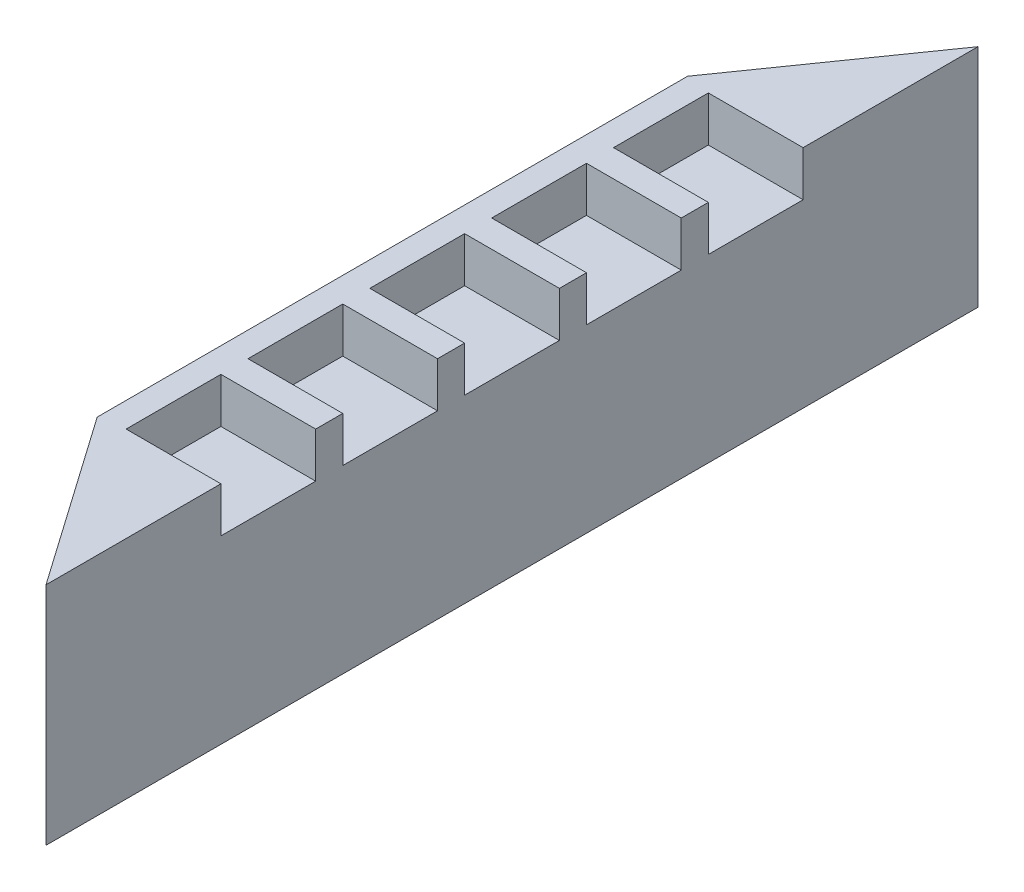
ISO-10303-21;
HEADER;
FILE_DESCRIPTION(('STEP AP214'),'2;1');
FILE_NAME('part.step','',(''),(''),'','','');
FILE_SCHEMA(('AUTOMOTIVE_DESIGN { 1 0 10303 214 1 1 1 1 }'));
ENDSEC;
DATA;
#1=APPLICATION_CONTEXT('core data for automotive mechanical design processes');
#2=APPLICATION_PROTOCOL_DEFINITION('international standard','automotive_design',2000,#1);
#3=PRODUCT_CONTEXT('',#1,'mechanical');
#4=PRODUCT('Part','Part','',(#3));
#5=PRODUCT_RELATED_PRODUCT_CATEGORY('part','',(#4));
#6=PRODUCT_DEFINITION_FORMATION('','',#4);
#7=PRODUCT_DEFINITION_CONTEXT('part definition',#1,'design');
#8=PRODUCT_DEFINITION('design','',#6,#7);
#9=PRODUCT_DEFINITION_SHAPE('','',#8);
#10=(LENGTH_UNIT() NAMED_UNIT(*) SI_UNIT(.MILLI.,.METRE.));
#11=(NAMED_UNIT(*) PLANE_ANGLE_UNIT() SI_UNIT($,.RADIAN.));
#12=(NAMED_UNIT(*) SI_UNIT($,.STERADIAN.) SOLID_ANGLE_UNIT());
#13=UNCERTAINTY_MEASURE_WITH_UNIT(LENGTH_MEASURE(1.E-05),#10,'distance_accuracy_value','');
#14=(GEOMETRIC_REPRESENTATION_CONTEXT(3) GLOBAL_UNCERTAINTY_ASSIGNED_CONTEXT((#13)) GLOBAL_UNIT_ASSIGNED_CONTEXT((#10,
#11,#12)) REPRESENTATION_CONTEXT('',''));
#15=CARTESIAN_POINT('',(0.,0.,0.));
#16=DIRECTION('',(0.,0.,1.));
#17=DIRECTION('',(1.,0.,0.));
#18=AXIS2_PLACEMENT_3D('',#15,#16,#17);
#19=CARTESIAN_POINT('',(-265.,500.,-654.04077821334));
#20=DIRECTION('',(0.819152044288992,0.,0.573576436351047));
#21=DIRECTION('',(0.573576436351047,0.,-0.819152044288992));
#22=AXIS2_PLACEMENT_3D('',#19,#20,#21);
#23=PLANE('',#22);
#24=DIRECTION('',(-0.573576436351047,0.,0.819152044288992));
#25=VECTOR('',#24,1.);
#26=CARTESIAN_POINT('',(-265.,0.,-654.04077821334));
#27=LINE('',#26,#25);
#28=CARTESIAN_POINT('',(0.,0.,-1032.5));
#29=VERTEX_POINT('',#28);
#30=CARTESIAN_POINT('',(-265.,0.,-654.04077821334));
#31=VERTEX_POINT('',#30);
#32=EDGE_CURVE('E333',#29,#31,#27,.T.);
#33=ORIENTED_EDGE('',*,*,#32,.T.);
#34=DIRECTION('',(0.,-1.,0.));
#35=VECTOR('',#34,1.);
#36=CARTESIAN_POINT('',(-265.,500.,-654.04077821334));
#37=LINE('',#36,#35);
#38=CARTESIAN_POINT('',(-265.,500.,-654.04077821334));
#39=VERTEX_POINT('',#38);
#40=EDGE_CURVE('E11',#39,#31,#37,.T.);
#41=ORIENTED_EDGE('',*,*,#40,.F.);
#42=DIRECTION('',(-0.573576436351047,0.,0.819152044288992));
#43=VECTOR('',#42,1.);
#44=CARTESIAN_POINT('',(-265.,500.,-654.04077821334));
#45=LINE('',#44,#43);
#46=CARTESIAN_POINT('',(0.,500.,-1032.5));
#47=VERTEX_POINT('',#46);
#48=EDGE_CURVE('E334',#47,#39,#45,.T.);
#49=ORIENTED_EDGE('',*,*,#48,.F.);
#50=DIRECTION('',(0.,-1.,0.));
#51=VECTOR('',#50,1.);
#52=CARTESIAN_POINT('',(0.,500.,-1032.5));
#53=LINE('',#52,#51);
#54=EDGE_CURVE('E345',#47,#29,#53,.T.);
#55=ORIENTED_EDGE('',*,*,#54,.T.);
#56=EDGE_LOOP('',(#33,#41,#49,#55));
#57=FACE_BOUND('',#56,.T.);
#58=ADVANCED_FACE('F36',(#57),#23,.F.);
#59=CARTESIAN_POINT('',(-265.,500.,654.04077821334));
#60=DIRECTION('',(1.,0.,0.));
#61=DIRECTION('',(0.,0.,-1.));
#62=AXIS2_PLACEMENT_3D('',#59,#60,#61);
#63=PLANE('',#62);
#64=DIRECTION('',(0.,0.,1.));
#65=VECTOR('',#64,1.);
#66=CARTESIAN_POINT('',(-265.,0.,654.04077821334));
#67=LINE('',#66,#65);
#68=CARTESIAN_POINT('',(-265.,0.,654.04077821334));
#69=VERTEX_POINT('',#68);
#70=EDGE_CURVE('E351',#31,#69,#67,.T.);
#71=ORIENTED_EDGE('',*,*,#70,.T.);
#72=DIRECTION('',(0.,-1.,0.));
#73=VECTOR('',#72,1.);
#74=CARTESIAN_POINT('',(-265.,500.,654.04077821334));
#75=LINE('',#74,#73);
#76=CARTESIAN_POINT('',(-265.,500.,654.04077821334));
#77=VERTEX_POINT('',#76);
#78=EDGE_CURVE('E43',#77,#69,#75,.T.);
#79=ORIENTED_EDGE('',*,*,#78,.F.);
#80=DIRECTION('',(0.,0.,1.));
#81=VECTOR('',#80,1.);
#82=CARTESIAN_POINT('',(-265.,500.,654.04077821334));
#83=LINE('',#82,#81);
#84=EDGE_CURVE('E337',#39,#77,#83,.T.);
#85=ORIENTED_EDGE('',*,*,#84,.F.);
#86=ORIENTED_EDGE('',*,*,#40,.T.);
#87=EDGE_LOOP('',(#71,#79,#85,#86));
#88=FACE_BOUND('',#87,.T.);
#89=ADVANCED_FACE('F428',(#88),#63,.F.);
#90=CARTESIAN_POINT('',(2.83199572302825E-13,500.,1032.5));
#91=DIRECTION('',(0.819152044288992,0.,-0.573576436351047));
#92=DIRECTION('',(-0.573576436351047,0.,-0.819152044288991));
#93=AXIS2_PLACEMENT_3D('',#90,#91,#92);
#94=PLANE('',#93);
#95=DIRECTION('',(0.573576436351047,0.,0.819152044288991));
#96=VECTOR('',#95,1.);
#97=CARTESIAN_POINT('',(2.83199572302825E-13,0.,1032.5));
#98=LINE('',#97,#96);
#99=CARTESIAN_POINT('',(2.83199572302825E-13,0.,1032.5));
#100=VERTEX_POINT('',#99);
#101=EDGE_CURVE('E353',#69,#100,#98,.T.);
#102=ORIENTED_EDGE('',*,*,#101,.T.);
#103=DIRECTION('',(0.,-1.,0.));
#104=VECTOR('',#103,1.);
#105=CARTESIAN_POINT('',(2.83199572302825E-13,500.,1032.5));
#106=LINE('',#105,#104);
#107=CARTESIAN_POINT('',(2.83199572302825E-13,500.,1032.5));
#108=VERTEX_POINT('',#107);
#109=EDGE_CURVE('E358',#108,#100,#106,.T.);
#110=ORIENTED_EDGE('',*,*,#109,.F.);
#111=DIRECTION('',(0.573576436351047,0.,0.819152044288991));
#112=VECTOR('',#111,1.);
#113=CARTESIAN_POINT('',(2.83199572302825E-13,500.,1032.5));
#114=LINE('',#113,#112);
#115=EDGE_CURVE('E340',#77,#108,#114,.T.);
#116=ORIENTED_EDGE('',*,*,#115,.F.);
#117=ORIENTED_EDGE('',*,*,#78,.T.);
#118=EDGE_LOOP('',(#102,#110,#116,#117));
#119=FACE_BOUND('',#118,.T.);
#120=ADVANCED_FACE('F365',(#119),#94,.F.);
#121=CARTESIAN_POINT('',(0.,500.,-1032.5));
#122=DIRECTION('',(-1.,0.,0.));
#123=DIRECTION('',(0.,0.,1.));
#124=AXIS2_PLACEMENT_3D('',#121,#122,#123);
#125=PLANE('',#124);
#126=DIRECTION('',(0.,0.,-1.));
#127=VECTOR('',#126,1.);
#128=CARTESIAN_POINT('',(2.14451515614146E-13,400.,-435.));
#129=LINE('',#128,#127);
#130=CARTESIAN_POINT('',(2.14451515614146E-13,400.,-435.));
#131=VERTEX_POINT('',#130);
#132=CARTESIAN_POINT('',(2.14451515614146E-13,400.,-645.));
#133=VERTEX_POINT('',#132);
#134=EDGE_CURVE('E249',#131,#133,#129,.T.);
#135=ORIENTED_EDGE('',*,*,#134,.F.);
#136=DIRECTION('',(0.,1.,0.));
#137=VECTOR('',#136,1.);
#138=CARTESIAN_POINT('',(2.14451515614146E-13,400.,-435.));
#139=LINE('',#138,#137);
#140=CARTESIAN_POINT('',(2.14451515614146E-13,500.,-435.));
#141=VERTEX_POINT('',#140);
#142=EDGE_CURVE('E246',#131,#141,#139,.T.);
#143=ORIENTED_EDGE('',*,*,#142,.T.);
#144=DIRECTION('',(0.,0.,-1.));
#145=VECTOR('',#144,1.);
#146=CARTESIAN_POINT('',(0.,500.,-1032.5));
#147=LINE('',#146,#145);
#148=CARTESIAN_POINT('',(1.10830535322835E-13,500.,-375.));
#149=VERTEX_POINT('',#148);
#150=EDGE_CURVE('E383',#149,#141,#147,.T.);
#151=ORIENTED_EDGE('',*,*,#150,.F.);
#152=DIRECTION('',(0.,1.,0.));
#153=VECTOR('',#152,1.);
#154=CARTESIAN_POINT('',(2.48825543958485E-13,400.,-375.));
#155=LINE('',#154,#153);
#156=CARTESIAN_POINT('',(2.48825543958485E-13,400.,-375.));
#157=VERTEX_POINT('',#156);
#158=EDGE_CURVE('E286',#157,#149,#155,.T.);
#159=ORIENTED_EDGE('',*,*,#158,.F.);
#160=DIRECTION('',(0.,0.,-1.));
#161=VECTOR('',#160,1.);
#162=CARTESIAN_POINT('',(2.48825543958485E-13,400.,-165.));
#163=LINE('',#162,#161);
#164=CARTESIAN_POINT('',(2.48825543958485E-13,400.,-165.));
#165=VERTEX_POINT('',#164);
#166=EDGE_CURVE('E298',#165,#157,#163,.T.);
#167=ORIENTED_EDGE('',*,*,#166,.F.);
#168=DIRECTION('',(0.,1.,0.));
#169=VECTOR('',#168,1.);
#170=CARTESIAN_POINT('',(2.48825543958485E-13,400.,-165.));
#171=LINE('',#170,#169);
#172=CARTESIAN_POINT('',(2.48825543958485E-13,500.,-165.));
#173=VERTEX_POINT('',#172);
#174=EDGE_CURVE('E295',#165,#173,#171,.T.);
#175=ORIENTED_EDGE('',*,*,#174,.T.);
#176=CARTESIAN_POINT('',(1.43895998899814E-13,500.,-105.));
#177=VERTEX_POINT('',#176);
#178=EDGE_CURVE('E348',#177,#173,#147,.T.);
#179=ORIENTED_EDGE('',*,*,#178,.F.);
#180=DIRECTION('',(0.,1.,0.));
#181=VECTOR('',#180,1.);
#182=CARTESIAN_POINT('',(2.83199572302825E-13,400.,-105.));
#183=LINE('',#182,#181);
#184=CARTESIAN_POINT('',(2.83199572302825E-13,400.,-105.));
#185=VERTEX_POINT('',#184);
#186=EDGE_CURVE('E314',#185,#177,#183,.T.);
#187=ORIENTED_EDGE('',*,*,#186,.F.);
#188=DIRECTION('',(0.,0.,-1.));
#189=VECTOR('',#188,1.);
#190=CARTESIAN_POINT('',(2.83199572302825E-13,400.,105.));
#191=LINE('',#190,#189);
#192=CARTESIAN_POINT('',(2.83199572302825E-13,400.,105.));
#193=VERTEX_POINT('',#192);
#194=EDGE_CURVE('E326',#193,#185,#191,.T.);
#195=ORIENTED_EDGE('',*,*,#194,.F.);
#196=DIRECTION('',(0.,1.,0.));
#197=VECTOR('',#196,1.);
#198=CARTESIAN_POINT('',(2.83199572302825E-13,400.,105.));
#199=LINE('',#198,#197);
#200=CARTESIAN_POINT('',(2.83199572302825E-13,500.,105.));
#201=VERTEX_POINT('',#200);
#202=EDGE_CURVE('E323',#193,#201,#199,.T.);
#203=ORIENTED_EDGE('',*,*,#202,.T.);
#204=CARTESIAN_POINT('',(1.76961462476792E-13,500.,165.));
#205=VERTEX_POINT('',#204);
#206=EDGE_CURVE('E347',#205,#201,#147,.T.);
#207=ORIENTED_EDGE('',*,*,#206,.F.);
#208=DIRECTION('',(0.,1.,0.));
#209=VECTOR('',#208,1.);
#210=CARTESIAN_POINT('',(3.17573600647165E-13,400.,165.));
#211=LINE('',#210,#209);
#212=CARTESIAN_POINT('',(3.17573600647165E-13,400.,165.));
#213=VERTEX_POINT('',#212);
#214=EDGE_CURVE('E50',#213,#205,#211,.T.);
#215=ORIENTED_EDGE('',*,*,#214,.F.);
#216=DIRECTION('',(0.,0.,-1.));
#217=VECTOR('',#216,1.);
#218=CARTESIAN_POINT('',(3.17573600647165E-13,400.,375.));
#219=LINE('',#218,#217);
#220=CARTESIAN_POINT('',(3.17573600647165E-13,400.,375.));
#221=VERTEX_POINT('',#220);
#222=EDGE_CURVE('E272',#221,#213,#219,.T.);
#223=ORIENTED_EDGE('',*,*,#222,.F.);
#224=DIRECTION('',(0.,1.,0.));
#225=VECTOR('',#224,1.);
#226=CARTESIAN_POINT('',(3.17573600647165E-13,400.,375.));
#227=LINE('',#226,#225);
#228=CARTESIAN_POINT('',(3.17573600647165E-13,500.,375.));
#229=VERTEX_POINT('',#228);
#230=EDGE_CURVE('E269',#221,#229,#227,.T.);
#231=ORIENTED_EDGE('',*,*,#230,.T.);
#232=CARTESIAN_POINT('',(2.10026926053771E-13,500.,435.));
#233=VERTEX_POINT('',#232);
#234=EDGE_CURVE('E346',#233,#229,#147,.T.);
#235=ORIENTED_EDGE('',*,*,#234,.F.);
#236=DIRECTION('',(0.,1.,0.));
#237=VECTOR('',#236,1.);
#238=CARTESIAN_POINT('',(3.51947628991505E-13,400.,435.));
#239=LINE('',#238,#237);
#240=CARTESIAN_POINT('',(3.51947628991505E-13,400.,435.));
#241=VERTEX_POINT('',#240);
#242=EDGE_CURVE('E58',#241,#233,#239,.T.);
#243=ORIENTED_EDGE('',*,*,#242,.F.);
#244=DIRECTION('',(0.,0.,-1.));
#245=VECTOR('',#244,1.);
#246=CARTESIAN_POINT('',(3.51947628991505E-13,400.,645.));
#247=LINE('',#246,#245);
#248=CARTESIAN_POINT('',(3.51947628991505E-13,400.,645.));
#249=VERTEX_POINT('',#248);
#250=EDGE_CURVE('E224',#249,#241,#247,.T.);
#251=ORIENTED_EDGE('',*,*,#250,.F.);
#252=DIRECTION('',(0.,1.,0.));
#253=VECTOR('',#252,1.);
#254=CARTESIAN_POINT('',(3.51947628991505E-13,400.,645.));
#255=LINE('',#254,#253);
#256=CARTESIAN_POINT('',(3.51947628991505E-13,500.,645.));
#257=VERTEX_POINT('',#256);
#258=EDGE_CURVE('E506',#249,#257,#255,.T.);
#259=ORIENTED_EDGE('',*,*,#258,.T.);
#260=EDGE_CURVE('E343',#108,#257,#147,.T.);
#261=ORIENTED_EDGE('',*,*,#260,.F.);
#262=ORIENTED_EDGE('',*,*,#109,.T.);
#263=DIRECTION('',(0.,0.,-1.));
#264=VECTOR('',#263,1.);
#265=CARTESIAN_POINT('',(0.,0.,-1032.5));
#266=LINE('',#265,#264);
#267=EDGE_CURVE('E338',#100,#29,#266,.T.);
#268=ORIENTED_EDGE('',*,*,#267,.T.);
#269=ORIENTED_EDGE('',*,*,#54,.F.);
#270=CARTESIAN_POINT('',(0.,500.,-645.));
#271=VERTEX_POINT('',#270);
#272=EDGE_CURVE('E342',#271,#47,#147,.T.);
#273=ORIENTED_EDGE('',*,*,#272,.F.);
#274=DIRECTION('',(0.,1.,0.));
#275=VECTOR('',#274,1.);
#276=CARTESIAN_POINT('',(2.14451515614146E-13,400.,-645.));
#277=LINE('',#276,#275);
#278=EDGE_CURVE('E238',#133,#271,#277,.T.);
#279=ORIENTED_EDGE('',*,*,#278,.F.);
#280=EDGE_LOOP('',(#135,#143,#151,#159,#167,#175,#179,#187,#195,#203,#207,#215,#223,#231,#235,
#243,#251,#259,#261,#262,#268,#269,#273,#279));
#281=FACE_BOUND('',#280,.T.);
#282=ADVANCED_FACE('F375',(#281),#125,.F.);
#283=CARTESIAN_POINT('',(0.,500.,0.));
#284=DIRECTION('',(0.,1.,0.));
#285=DIRECTION('',(0.,0.,1.));
#286=AXIS2_PLACEMENT_3D('',#283,#284,#285);
#287=PLANE('',#286);
#288=DIRECTION('',(-1.,0.,0.));
#289=VECTOR('',#288,1.);
#290=CARTESIAN_POINT('',(2.14451515614146E-13,500.,-435.));
#291=LINE('',#290,#289);
#292=CARTESIAN_POINT('',(-210.,500.,-435.));
#293=VERTEX_POINT('',#292);
#294=EDGE_CURVE('E240',#141,#293,#291,.T.);
#295=ORIENTED_EDGE('',*,*,#294,.T.);
#296=DIRECTION('',(0.,0.,-1.));
#297=VECTOR('',#296,1.);
#298=CARTESIAN_POINT('',(-210.,500.,-435.));
#299=LINE('',#298,#297);
#300=CARTESIAN_POINT('',(-210.,500.,-645.));
#301=VERTEX_POINT('',#300);
#302=EDGE_CURVE('E253',#293,#301,#299,.T.);
#303=ORIENTED_EDGE('',*,*,#302,.T.);
#304=DIRECTION('',(-1.,0.,0.));
#305=VECTOR('',#304,1.);
#306=CARTESIAN_POINT('',(2.14451515614146E-13,500.,-645.));
#307=LINE('',#306,#305);
#308=EDGE_CURVE('E228',#271,#301,#307,.T.);
#309=ORIENTED_EDGE('',*,*,#308,.F.);
#310=ORIENTED_EDGE('',*,*,#272,.T.);
#311=ORIENTED_EDGE('',*,*,#48,.T.);
#312=ORIENTED_EDGE('',*,*,#84,.T.);
#313=ORIENTED_EDGE('',*,*,#115,.T.);
#314=ORIENTED_EDGE('',*,*,#260,.T.);
#315=DIRECTION('',(-1.,0.,0.));
#316=VECTOR('',#315,1.);
#317=CARTESIAN_POINT('',(3.51947628991505E-13,500.,645.));
#318=LINE('',#317,#316);
#319=CARTESIAN_POINT('',(-210.,500.,645.));
#320=VERTEX_POINT('',#319);
#321=EDGE_CURVE('E219',#257,#320,#318,.T.);
#322=ORIENTED_EDGE('',*,*,#321,.T.);
#323=DIRECTION('',(0.,0.,-1.));
#324=VECTOR('',#323,1.);
#325=CARTESIAN_POINT('',(-210.,500.,645.));
#326=LINE('',#325,#324);
#327=CARTESIAN_POINT('',(-210.,500.,435.));
#328=VERTEX_POINT('',#327);
#329=EDGE_CURVE('E203',#320,#328,#326,.T.);
#330=ORIENTED_EDGE('',*,*,#329,.T.);
#331=DIRECTION('',(-1.,0.,0.));
#332=VECTOR('',#331,1.);
#333=CARTESIAN_POINT('',(3.51947628991505E-13,500.,435.));
#334=LINE('',#333,#332);
#335=EDGE_CURVE('E209',#233,#328,#334,.T.);
#336=ORIENTED_EDGE('',*,*,#335,.F.);
#337=ORIENTED_EDGE('',*,*,#234,.T.);
#338=DIRECTION('',(-1.,0.,0.));
#339=VECTOR('',#338,1.);
#340=CARTESIAN_POINT('',(3.17573600647165E-13,500.,375.));
#341=LINE('',#340,#339);
#342=CARTESIAN_POINT('',(-210.,500.,375.));
#343=VERTEX_POINT('',#342);
#344=EDGE_CURVE('E262',#229,#343,#341,.T.);
#345=ORIENTED_EDGE('',*,*,#344,.T.);
#346=DIRECTION('',(0.,0.,-1.));
#347=VECTOR('',#346,1.);
#348=CARTESIAN_POINT('',(-210.,500.,375.));
#349=LINE('',#348,#347);
#350=CARTESIAN_POINT('',(-210.,500.,165.));
#351=VERTEX_POINT('',#350);
#352=EDGE_CURVE('E232',#343,#351,#349,.T.);
#353=ORIENTED_EDGE('',*,*,#352,.T.);
#354=DIRECTION('',(-1.,0.,0.));
#355=VECTOR('',#354,1.);
#356=CARTESIAN_POINT('',(3.17573600647165E-13,500.,165.));
#357=LINE('',#356,#355);
#358=EDGE_CURVE('E220',#205,#351,#357,.T.);
#359=ORIENTED_EDGE('',*,*,#358,.F.);
#360=ORIENTED_EDGE('',*,*,#206,.T.);
#361=DIRECTION('',(-1.,0.,0.));
#362=VECTOR('',#361,1.);
#363=CARTESIAN_POINT('',(2.83199572302825E-13,500.,105.));
#364=LINE('',#363,#362);
#365=CARTESIAN_POINT('',(-210.,500.,105.));
#366=VERTEX_POINT('',#365);
#367=EDGE_CURVE('E316',#201,#366,#364,.T.);
#368=ORIENTED_EDGE('',*,*,#367,.T.);
#369=DIRECTION('',(0.,0.,-1.));
#370=VECTOR('',#369,1.);
#371=CARTESIAN_POINT('',(-210.,500.,105.));
#372=LINE('',#371,#370);
#373=CARTESIAN_POINT('',(-210.,500.,-105.));
#374=VERTEX_POINT('',#373);
#375=EDGE_CURVE('E330',#366,#374,#372,.T.);
#376=ORIENTED_EDGE('',*,*,#375,.T.);
#377=DIRECTION('',(-1.,0.,0.));
#378=VECTOR('',#377,1.);
#379=CARTESIAN_POINT('',(2.83199572302825E-13,500.,-105.));
#380=LINE('',#379,#378);
#381=EDGE_CURVE('E305',#177,#374,#380,.T.);
#382=ORIENTED_EDGE('',*,*,#381,.F.);
#383=ORIENTED_EDGE('',*,*,#178,.T.);
#384=DIRECTION('',(-1.,0.,0.));
#385=VECTOR('',#384,1.);
#386=CARTESIAN_POINT('',(2.48825543958485E-13,500.,-165.));
#387=LINE('',#386,#385);
#388=CARTESIAN_POINT('',(-210.,500.,-165.));
#389=VERTEX_POINT('',#388);
#390=EDGE_CURVE('E288',#173,#389,#387,.T.);
#391=ORIENTED_EDGE('',*,*,#390,.T.);
#392=DIRECTION('',(0.,0.,-1.));
#393=VECTOR('',#392,1.);
#394=CARTESIAN_POINT('',(-210.,500.,-165.));
#395=LINE('',#394,#393);
#396=CARTESIAN_POINT('',(-210.,500.,-375.));
#397=VERTEX_POINT('',#396);
#398=EDGE_CURVE('E302',#389,#397,#395,.T.);
#399=ORIENTED_EDGE('',*,*,#398,.T.);
#400=DIRECTION('',(-1.,0.,0.));
#401=VECTOR('',#400,1.);
#402=CARTESIAN_POINT('',(2.48825543958485E-13,500.,-375.));
#403=LINE('',#402,#401);
#404=EDGE_CURVE('E255',#149,#397,#403,.T.);
#405=ORIENTED_EDGE('',*,*,#404,.F.);
#406=ORIENTED_EDGE('',*,*,#150,.T.);
#407=EDGE_LOOP('',(#295,#303,#309,#310,#311,#312,#313,#314,#322,#330,#336,#337,#345,#353,#359,
#360,#368,#376,#382,#383,#391,#399,#405,#406));
#408=FACE_BOUND('',#407,.T.);
#409=ADVANCED_FACE('F217',(#408),#287,.T.);
#410=CARTESIAN_POINT('',(0.,0.,0.));
#411=DIRECTION('',(0.,1.,0.));
#412=DIRECTION('',(0.,0.,1.));
#413=AXIS2_PLACEMENT_3D('',#410,#411,#412);
#414=PLANE('',#413);
#415=ORIENTED_EDGE('',*,*,#32,.F.);
#416=ORIENTED_EDGE('',*,*,#267,.F.);
#417=ORIENTED_EDGE('',*,*,#101,.F.);
#418=ORIENTED_EDGE('',*,*,#70,.F.);
#419=EDGE_LOOP('',(#415,#416,#417,#418));
#420=FACE_BOUND('',#419,.T.);
#421=ADVANCED_FACE('F371',(#420),#414,.F.);
#422=CARTESIAN_POINT('',(-210.,500.,105.));
#423=DIRECTION('',(1.,0.,0.));
#424=DIRECTION('',(0.,0.,-1.));
#425=AXIS2_PLACEMENT_3D('',#422,#423,#424);
#426=PLANE('',#425);
#427=ORIENTED_EDGE('',*,*,#375,.F.);
#428=DIRECTION('',(0.,-1.,0.));
#429=VECTOR('',#428,1.);
#430=CARTESIAN_POINT('',(-210.,500.,105.));
#431=LINE('',#430,#429);
#432=CARTESIAN_POINT('',(-210.,400.,105.));
#433=VERTEX_POINT('',#432);
#434=EDGE_CURVE('E319',#366,#433,#431,.T.);
#435=ORIENTED_EDGE('',*,*,#434,.T.);
#436=DIRECTION('',(0.,0.,-1.));
#437=VECTOR('',#436,1.);
#438=CARTESIAN_POINT('',(-210.,400.,105.));
#439=LINE('',#438,#437);
#440=CARTESIAN_POINT('',(-210.,400.,-105.));
#441=VERTEX_POINT('',#440);
#442=EDGE_CURVE('E328',#433,#441,#439,.T.);
#443=ORIENTED_EDGE('',*,*,#442,.T.);
#444=DIRECTION('',(0.,-1.,0.));
#445=VECTOR('',#444,1.);
#446=CARTESIAN_POINT('',(-210.,500.,-105.));
#447=LINE('',#446,#445);
#448=EDGE_CURVE('E308',#374,#441,#447,.T.);
#449=ORIENTED_EDGE('',*,*,#448,.F.);
#450=EDGE_LOOP('',(#427,#435,#443,#449));
#451=FACE_BOUND('',#450,.T.);
#452=ADVANCED_FACE('F441',(#451),#426,.T.);
#453=CARTESIAN_POINT('',(-210.,400.,105.));
#454=DIRECTION('',(0.,1.,0.));
#455=DIRECTION('',(0.,0.,1.));
#456=AXIS2_PLACEMENT_3D('',#453,#454,#455);
#457=PLANE('',#456);
#458=ORIENTED_EDGE('',*,*,#442,.F.);
#459=DIRECTION('',(1.,0.,0.));
#460=VECTOR('',#459,1.);
#461=CARTESIAN_POINT('',(-210.,400.,105.));
#462=LINE('',#461,#460);
#463=EDGE_CURVE('E321',#433,#193,#462,.T.);
#464=ORIENTED_EDGE('',*,*,#463,.T.);
#465=ORIENTED_EDGE('',*,*,#194,.T.);
#466=DIRECTION('',(1.,0.,0.));
#467=VECTOR('',#466,1.);
#468=CARTESIAN_POINT('',(-210.,400.,-105.));
#469=LINE('',#468,#467);
#470=EDGE_CURVE('E311',#441,#185,#469,.T.);
#471=ORIENTED_EDGE('',*,*,#470,.F.);
#472=EDGE_LOOP('',(#458,#464,#465,#471));
#473=FACE_BOUND('',#472,.T.);
#474=ADVANCED_FACE('F446',(#473),#457,.T.);
#475=CARTESIAN_POINT('',(0.,0.,105.));
#476=DIRECTION('',(0.,0.,1.));
#477=DIRECTION('',(1.,0.,0.));
#478=AXIS2_PLACEMENT_3D('',#475,#476,#477);
#479=PLANE('',#478);
#480=ORIENTED_EDGE('',*,*,#367,.F.);
#481=ORIENTED_EDGE('',*,*,#202,.F.);
#482=ORIENTED_EDGE('',*,*,#463,.F.);
#483=ORIENTED_EDGE('',*,*,#434,.F.);
#484=EDGE_LOOP('',(#480,#481,#482,#483));
#485=FACE_BOUND('',#484,.T.);
#486=ADVANCED_FACE('F450',(#485),#479,.F.);
#487=CARTESIAN_POINT('',(0.,0.,-105.));
#488=DIRECTION('',(0.,0.,1.));
#489=DIRECTION('',(1.,0.,0.));
#490=AXIS2_PLACEMENT_3D('',#487,#488,#489);
#491=PLANE('',#490);
#492=ORIENTED_EDGE('',*,*,#381,.T.);
#493=ORIENTED_EDGE('',*,*,#448,.T.);
#494=ORIENTED_EDGE('',*,*,#470,.T.);
#495=ORIENTED_EDGE('',*,*,#186,.T.);
#496=EDGE_LOOP('',(#492,#493,#494,#495));
#497=FACE_BOUND('',#496,.T.);
#498=ADVANCED_FACE('F454',(#497),#491,.T.);
#499=CARTESIAN_POINT('',(-210.,500.,-165.));
#500=DIRECTION('',(1.,0.,0.));
#501=DIRECTION('',(0.,0.,-1.));
#502=AXIS2_PLACEMENT_3D('',#499,#500,#501);
#503=PLANE('',#502);
#504=ORIENTED_EDGE('',*,*,#398,.F.);
#505=DIRECTION('',(0.,-1.,0.));
#506=VECTOR('',#505,1.);
#507=CARTESIAN_POINT('',(-210.,500.,-165.));
#508=LINE('',#507,#506);
#509=CARTESIAN_POINT('',(-210.,400.,-165.));
#510=VERTEX_POINT('',#509);
#511=EDGE_CURVE('E291',#389,#510,#508,.T.);
#512=ORIENTED_EDGE('',*,*,#511,.T.);
#513=DIRECTION('',(0.,0.,-1.));
#514=VECTOR('',#513,1.);
#515=CARTESIAN_POINT('',(-210.,400.,-165.));
#516=LINE('',#515,#514);
#517=CARTESIAN_POINT('',(-210.,400.,-375.));
#518=VERTEX_POINT('',#517);
#519=EDGE_CURVE('E300',#510,#518,#516,.T.);
#520=ORIENTED_EDGE('',*,*,#519,.T.);
#521=DIRECTION('',(0.,-1.,0.));
#522=VECTOR('',#521,1.);
#523=CARTESIAN_POINT('',(-210.,500.,-375.));
#524=LINE('',#523,#522);
#525=EDGE_CURVE('E280',#397,#518,#524,.T.);
#526=ORIENTED_EDGE('',*,*,#525,.F.);
#527=EDGE_LOOP('',(#504,#512,#520,#526));
#528=FACE_BOUND('',#527,.T.);
#529=ADVANCED_FACE('F401',(#528),#503,.T.);
#530=CARTESIAN_POINT('',(-210.,400.,-165.));
#531=DIRECTION('',(0.,1.,0.));
#532=DIRECTION('',(0.,0.,1.));
#533=AXIS2_PLACEMENT_3D('',#530,#531,#532);
#534=PLANE('',#533);
#535=ORIENTED_EDGE('',*,*,#519,.F.);
#536=DIRECTION('',(1.,0.,0.));
#537=VECTOR('',#536,1.);
#538=CARTESIAN_POINT('',(-210.,400.,-165.));
#539=LINE('',#538,#537);
#540=EDGE_CURVE('E293',#510,#165,#539,.T.);
#541=ORIENTED_EDGE('',*,*,#540,.T.);
#542=ORIENTED_EDGE('',*,*,#166,.T.);
#543=DIRECTION('',(1.,0.,0.));
#544=VECTOR('',#543,1.);
#545=CARTESIAN_POINT('',(-210.,400.,-375.));
#546=LINE('',#545,#544);
#547=EDGE_CURVE('E283',#518,#157,#546,.T.);
#548=ORIENTED_EDGE('',*,*,#547,.F.);
#549=EDGE_LOOP('',(#535,#541,#542,#548));
#550=FACE_BOUND('',#549,.T.);
#551=ADVANCED_FACE('F461',(#550),#534,.T.);
#552=CARTESIAN_POINT('',(0.,0.,-165.));
#553=DIRECTION('',(0.,0.,1.));
#554=DIRECTION('',(1.,0.,0.));
#555=AXIS2_PLACEMENT_3D('',#552,#553,#554);
#556=PLANE('',#555);
#557=ORIENTED_EDGE('',*,*,#390,.F.);
#558=ORIENTED_EDGE('',*,*,#174,.F.);
#559=ORIENTED_EDGE('',*,*,#540,.F.);
#560=ORIENTED_EDGE('',*,*,#511,.F.);
#561=EDGE_LOOP('',(#557,#558,#559,#560));
#562=FACE_BOUND('',#561,.T.);
#563=ADVANCED_FACE('F397',(#562),#556,.F.);
#564=CARTESIAN_POINT('',(0.,0.,-375.));
#565=DIRECTION('',(0.,0.,1.));
#566=DIRECTION('',(1.,0.,0.));
#567=AXIS2_PLACEMENT_3D('',#564,#565,#566);
#568=PLANE('',#567);
#569=ORIENTED_EDGE('',*,*,#404,.T.);
#570=ORIENTED_EDGE('',*,*,#525,.T.);
#571=ORIENTED_EDGE('',*,*,#547,.T.);
#572=ORIENTED_EDGE('',*,*,#158,.T.);
#573=EDGE_LOOP('',(#569,#570,#571,#572));
#574=FACE_BOUND('',#573,.T.);
#575=ADVANCED_FACE('F467',(#574),#568,.T.);
#576=CARTESIAN_POINT('',(-210.,500.,645.));
#577=DIRECTION('',(1.,0.,0.));
#578=DIRECTION('',(0.,0.,-1.));
#579=AXIS2_PLACEMENT_3D('',#576,#577,#578);
#580=PLANE('',#579);
#581=ORIENTED_EDGE('',*,*,#329,.F.);
#582=DIRECTION('',(0.,-1.,0.));
#583=VECTOR('',#582,1.);
#584=CARTESIAN_POINT('',(-210.,500.,645.));
#585=LINE('',#584,#583);
#586=CARTESIAN_POINT('',(-210.,400.,645.));
#587=VERTEX_POINT('',#586);
#588=EDGE_CURVE('E499',#320,#587,#585,.T.);
#589=ORIENTED_EDGE('',*,*,#588,.T.);
#590=DIRECTION('',(0.,0.,-1.));
#591=VECTOR('',#590,1.);
#592=CARTESIAN_POINT('',(-210.,400.,645.));
#593=LINE('',#592,#591);
#594=CARTESIAN_POINT('',(-210.,400.,435.));
#595=VERTEX_POINT('',#594);
#596=EDGE_CURVE('E206',#587,#595,#593,.T.);
#597=ORIENTED_EDGE('',*,*,#596,.T.);
#598=DIRECTION('',(0.,-1.,0.));
#599=VECTOR('',#598,1.);
#600=CARTESIAN_POINT('',(-210.,500.,435.));
#601=LINE('',#600,#599);
#602=EDGE_CURVE('E200',#328,#595,#601,.T.);
#603=ORIENTED_EDGE('',*,*,#602,.F.);
#604=EDGE_LOOP('',(#581,#589,#597,#603));
#605=FACE_BOUND('',#604,.T.);
#606=ADVANCED_FACE('F201',(#605),#580,.T.);
#607=CARTESIAN_POINT('',(-210.,400.,645.));
#608=DIRECTION('',(0.,1.,0.));
#609=DIRECTION('',(0.,0.,1.));
#610=AXIS2_PLACEMENT_3D('',#607,#608,#609);
#611=PLANE('',#610);
#612=ORIENTED_EDGE('',*,*,#596,.F.);
#613=DIRECTION('',(1.,0.,0.));
#614=VECTOR('',#613,1.);
#615=CARTESIAN_POINT('',(-210.,400.,645.));
#616=LINE('',#615,#614);
#617=EDGE_CURVE('E504',#587,#249,#616,.T.);
#618=ORIENTED_EDGE('',*,*,#617,.T.);
#619=ORIENTED_EDGE('',*,*,#250,.T.);
#620=DIRECTION('',(1.,0.,0.));
#621=VECTOR('',#620,1.);
#622=CARTESIAN_POINT('',(-210.,400.,435.));
#623=LINE('',#622,#621);
#624=EDGE_CURVE('E208',#595,#241,#623,.T.);
#625=ORIENTED_EDGE('',*,*,#624,.F.);
#626=EDGE_LOOP('',(#612,#618,#619,#625));
#627=FACE_BOUND('',#626,.T.);
#628=ADVANCED_FACE('F508',(#627),#611,.T.);
#629=CARTESIAN_POINT('',(0.,0.,645.));
#630=DIRECTION('',(0.,0.,1.));
#631=DIRECTION('',(1.,0.,0.));
#632=AXIS2_PLACEMENT_3D('',#629,#630,#631);
#633=PLANE('',#632);
#634=ORIENTED_EDGE('',*,*,#321,.F.);
#635=ORIENTED_EDGE('',*,*,#258,.F.);
#636=ORIENTED_EDGE('',*,*,#617,.F.);
#637=ORIENTED_EDGE('',*,*,#588,.F.);
#638=EDGE_LOOP('',(#634,#635,#636,#637));
#639=FACE_BOUND('',#638,.T.);
#640=ADVANCED_FACE('F512',(#639),#633,.F.);
#641=CARTESIAN_POINT('',(0.,0.,435.));
#642=DIRECTION('',(0.,0.,1.));
#643=DIRECTION('',(1.,0.,0.));
#644=AXIS2_PLACEMENT_3D('',#641,#642,#643);
#645=PLANE('',#644);
#646=ORIENTED_EDGE('',*,*,#335,.T.);
#647=ORIENTED_EDGE('',*,*,#602,.T.);
#648=ORIENTED_EDGE('',*,*,#624,.T.);
#649=ORIENTED_EDGE('',*,*,#242,.T.);
#650=EDGE_LOOP('',(#646,#647,#648,#649));
#651=FACE_BOUND('',#650,.T.);
#652=ADVANCED_FACE('F211',(#651),#645,.T.);
#653=CARTESIAN_POINT('',(-210.,500.,375.));
#654=DIRECTION('',(1.,0.,0.));
#655=DIRECTION('',(0.,0.,-1.));
#656=AXIS2_PLACEMENT_3D('',#653,#654,#655);
#657=PLANE('',#656);
#658=ORIENTED_EDGE('',*,*,#352,.F.);
#659=DIRECTION('',(0.,-1.,0.));
#660=VECTOR('',#659,1.);
#661=CARTESIAN_POINT('',(-210.,500.,375.));
#662=LINE('',#661,#660);
#663=CARTESIAN_POINT('',(-210.,400.,375.));
#664=VERTEX_POINT('',#663);
#665=EDGE_CURVE('E265',#343,#664,#662,.T.);
#666=ORIENTED_EDGE('',*,*,#665,.T.);
#667=DIRECTION('',(0.,0.,-1.));
#668=VECTOR('',#667,1.);
#669=CARTESIAN_POINT('',(-210.,400.,375.));
#670=LINE('',#669,#668);
#671=CARTESIAN_POINT('',(-210.,400.,165.));
#672=VERTEX_POINT('',#671);
#673=EDGE_CURVE('E274',#664,#672,#670,.T.);
#674=ORIENTED_EDGE('',*,*,#673,.T.);
#675=DIRECTION('',(0.,-1.,0.));
#676=VECTOR('',#675,1.);
#677=CARTESIAN_POINT('',(-210.,500.,165.));
#678=LINE('',#677,#676);
#679=EDGE_CURVE('E222',#351,#672,#678,.T.);
#680=ORIENTED_EDGE('',*,*,#679,.F.);
#681=EDGE_LOOP('',(#658,#666,#674,#680));
#682=FACE_BOUND('',#681,.T.);
#683=ADVANCED_FACE('F470',(#682),#657,.T.);
#684=CARTESIAN_POINT('',(-210.,400.,375.));
#685=DIRECTION('',(0.,1.,0.));
#686=DIRECTION('',(0.,0.,1.));
#687=AXIS2_PLACEMENT_3D('',#684,#685,#686);
#688=PLANE('',#687);
#689=ORIENTED_EDGE('',*,*,#673,.F.);
#690=DIRECTION('',(1.,0.,0.));
#691=VECTOR('',#690,1.);
#692=CARTESIAN_POINT('',(-210.,400.,375.));
#693=LINE('',#692,#691);
#694=EDGE_CURVE('E267',#664,#221,#693,.T.);
#695=ORIENTED_EDGE('',*,*,#694,.T.);
#696=ORIENTED_EDGE('',*,*,#222,.T.);
#697=DIRECTION('',(1.,0.,0.));
#698=VECTOR('',#697,1.);
#699=CARTESIAN_POINT('',(-210.,400.,165.));
#700=LINE('',#699,#698);
#701=EDGE_CURVE('E259',#672,#213,#700,.T.);
#702=ORIENTED_EDGE('',*,*,#701,.F.);
#703=EDGE_LOOP('',(#689,#695,#696,#702));
#704=FACE_BOUND('',#703,.T.);
#705=ADVANCED_FACE('F473',(#704),#688,.T.);
#706=CARTESIAN_POINT('',(0.,0.,375.));
#707=DIRECTION('',(0.,0.,1.));
#708=DIRECTION('',(1.,0.,0.));
#709=AXIS2_PLACEMENT_3D('',#706,#707,#708);
#710=PLANE('',#709);
#711=ORIENTED_EDGE('',*,*,#344,.F.);
#712=ORIENTED_EDGE('',*,*,#230,.F.);
#713=ORIENTED_EDGE('',*,*,#694,.F.);
#714=ORIENTED_EDGE('',*,*,#665,.F.);
#715=EDGE_LOOP('',(#711,#712,#713,#714));
#716=FACE_BOUND('',#715,.T.);
#717=ADVANCED_FACE('F477',(#716),#710,.F.);
#718=CARTESIAN_POINT('',(0.,0.,165.));
#719=DIRECTION('',(0.,0.,1.));
#720=DIRECTION('',(1.,0.,0.));
#721=AXIS2_PLACEMENT_3D('',#718,#719,#720);
#722=PLANE('',#721);
#723=ORIENTED_EDGE('',*,*,#358,.T.);
#724=ORIENTED_EDGE('',*,*,#679,.T.);
#725=ORIENTED_EDGE('',*,*,#701,.T.);
#726=ORIENTED_EDGE('',*,*,#214,.T.);
#727=EDGE_LOOP('',(#723,#724,#725,#726));
#728=FACE_BOUND('',#727,.T.);
#729=ADVANCED_FACE('F425',(#728),#722,.T.);
#730=CARTESIAN_POINT('',(-210.,500.,-435.));
#731=DIRECTION('',(1.,0.,0.));
#732=DIRECTION('',(0.,0.,-1.));
#733=AXIS2_PLACEMENT_3D('',#730,#731,#732);
#734=PLANE('',#733);
#735=ORIENTED_EDGE('',*,*,#302,.F.);
#736=DIRECTION('',(0.,-1.,0.));
#737=VECTOR('',#736,1.);
#738=CARTESIAN_POINT('',(-210.,500.,-435.));
#739=LINE('',#738,#737);
#740=CARTESIAN_POINT('',(-210.,400.,-435.));
#741=VERTEX_POINT('',#740);
#742=EDGE_CURVE('E242',#293,#741,#739,.T.);
#743=ORIENTED_EDGE('',*,*,#742,.T.);
#744=DIRECTION('',(0.,0.,-1.));
#745=VECTOR('',#744,1.);
#746=CARTESIAN_POINT('',(-210.,400.,-435.));
#747=LINE('',#746,#745);
#748=CARTESIAN_POINT('',(-210.,400.,-645.));
#749=VERTEX_POINT('',#748);
#750=EDGE_CURVE('E251',#741,#749,#747,.T.);
#751=ORIENTED_EDGE('',*,*,#750,.T.);
#752=DIRECTION('',(0.,-1.,0.));
#753=VECTOR('',#752,1.);
#754=CARTESIAN_POINT('',(-210.,500.,-645.));
#755=LINE('',#754,#753);
#756=EDGE_CURVE('E231',#301,#749,#755,.T.);
#757=ORIENTED_EDGE('',*,*,#756,.F.);
#758=EDGE_LOOP('',(#735,#743,#751,#757));
#759=FACE_BOUND('',#758,.T.);
#760=ADVANCED_FACE('F411',(#759),#734,.T.);
#761=CARTESIAN_POINT('',(-210.,400.,-435.));
#762=DIRECTION('',(0.,1.,0.));
#763=DIRECTION('',(0.,0.,1.));
#764=AXIS2_PLACEMENT_3D('',#761,#762,#763);
#765=PLANE('',#764);
#766=ORIENTED_EDGE('',*,*,#750,.F.);
#767=DIRECTION('',(1.,0.,0.));
#768=VECTOR('',#767,1.);
#769=CARTESIAN_POINT('',(-210.,400.,-435.));
#770=LINE('',#769,#768);
#771=EDGE_CURVE('E244',#741,#131,#770,.T.);
#772=ORIENTED_EDGE('',*,*,#771,.T.);
#773=ORIENTED_EDGE('',*,*,#134,.T.);
#774=DIRECTION('',(1.,0.,0.));
#775=VECTOR('',#774,1.);
#776=CARTESIAN_POINT('',(-210.,400.,-645.));
#777=LINE('',#776,#775);
#778=EDGE_CURVE('E235',#749,#133,#777,.T.);
#779=ORIENTED_EDGE('',*,*,#778,.F.);
#780=EDGE_LOOP('',(#766,#772,#773,#779));
#781=FACE_BOUND('',#780,.T.);
#782=ADVANCED_FACE('F417',(#781),#765,.T.);
#783=CARTESIAN_POINT('',(0.,0.,-435.));
#784=DIRECTION('',(0.,0.,1.));
#785=DIRECTION('',(1.,0.,0.));
#786=AXIS2_PLACEMENT_3D('',#783,#784,#785);
#787=PLANE('',#786);
#788=ORIENTED_EDGE('',*,*,#294,.F.);
#789=ORIENTED_EDGE('',*,*,#142,.F.);
#790=ORIENTED_EDGE('',*,*,#771,.F.);
#791=ORIENTED_EDGE('',*,*,#742,.F.);
#792=EDGE_LOOP('',(#788,#789,#790,#791));
#793=FACE_BOUND('',#792,.T.);
#794=ADVANCED_FACE('F408',(#793),#787,.F.);
#795=CARTESIAN_POINT('',(0.,0.,-645.));
#796=DIRECTION('',(0.,0.,1.));
#797=DIRECTION('',(1.,0.,0.));
#798=AXIS2_PLACEMENT_3D('',#795,#796,#797);
#799=PLANE('',#798);
#800=ORIENTED_EDGE('',*,*,#308,.T.);
#801=ORIENTED_EDGE('',*,*,#756,.T.);
#802=ORIENTED_EDGE('',*,*,#778,.T.);
#803=ORIENTED_EDGE('',*,*,#278,.T.);
#804=EDGE_LOOP('',(#800,#801,#802,#803));
#805=FACE_BOUND('',#804,.T.);
#806=ADVANCED_FACE('F415',(#805),#799,.T.);
#807=CLOSED_SHELL('',(#58,#89,#120,#282,#409,#421,#452,#474,#486,#498,#529,#551,#563,#575,#606,
#628,#640,#652,#683,#705,#717,#729,#760,#782,#794,#806));
#808=MANIFOLD_SOLID_BREP('B2',#807);
#809=ADVANCED_BREP_SHAPE_REPRESENTATION('',(#18,#808),#14);
#810=SHAPE_DEFINITION_REPRESENTATION(#9,#809);
ENDSEC;
END-ISO-10303-21;
